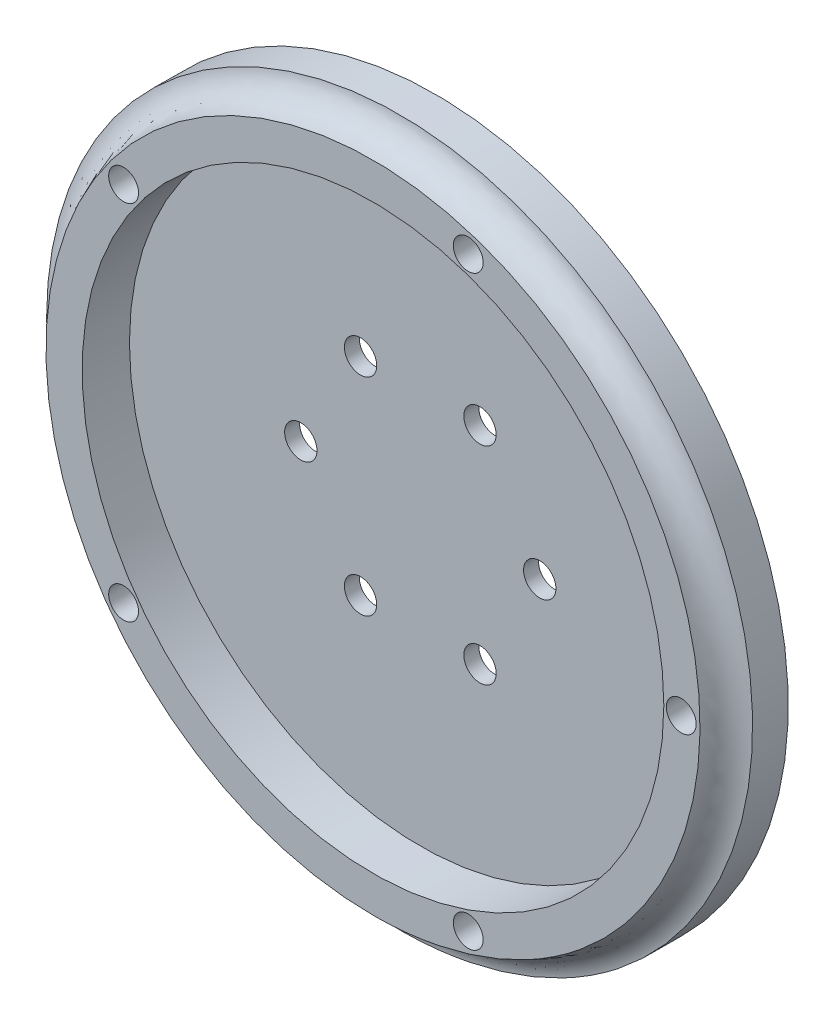
ISO-10303-21;
HEADER;
FILE_DESCRIPTION(('STEP AP214'),'2;1');
FILE_NAME('part.step','',(''),(''),'','','');
FILE_SCHEMA(('AUTOMOTIVE_DESIGN { 1 0 10303 214 1 1 1 1 }'));
ENDSEC;
DATA;
#1=APPLICATION_CONTEXT('core data for automotive mechanical design processes');
#2=APPLICATION_PROTOCOL_DEFINITION('international standard','automotive_design',2000,#1);
#3=PRODUCT_CONTEXT('',#1,'mechanical');
#4=PRODUCT('Part','Part','',(#3));
#5=PRODUCT_RELATED_PRODUCT_CATEGORY('part','',(#4));
#6=PRODUCT_DEFINITION_FORMATION('','',#4);
#7=PRODUCT_DEFINITION_CONTEXT('part definition',#1,'design');
#8=PRODUCT_DEFINITION('design','',#6,#7);
#9=PRODUCT_DEFINITION_SHAPE('','',#8);
#10=(LENGTH_UNIT() NAMED_UNIT(*) SI_UNIT(.MILLI.,.METRE.));
#11=(NAMED_UNIT(*) PLANE_ANGLE_UNIT() SI_UNIT($,.RADIAN.));
#12=(NAMED_UNIT(*) SI_UNIT($,.STERADIAN.) SOLID_ANGLE_UNIT());
#13=UNCERTAINTY_MEASURE_WITH_UNIT(LENGTH_MEASURE(1.E-05),#10,'distance_accuracy_value','');
#14=(GEOMETRIC_REPRESENTATION_CONTEXT(3) GLOBAL_UNCERTAINTY_ASSIGNED_CONTEXT((#13)) GLOBAL_UNIT_ASSIGNED_CONTEXT((#10,
#11,#12)) REPRESENTATION_CONTEXT('',''));
#15=CARTESIAN_POINT('',(0.,0.,0.));
#16=DIRECTION('',(0.,0.,1.));
#17=DIRECTION('',(1.,0.,0.));
#18=AXIS2_PLACEMENT_3D('',#15,#16,#17);
#19=CARTESIAN_POINT('',(0.,0.,68.3518381281178));
#20=DIRECTION('',(0.,0.,1.));
#21=DIRECTION('',(1.,0.,0.));
#22=AXIS2_PLACEMENT_3D('',#19,#20,#21);
#23=PLANE('',#22);
#24=CARTESIAN_POINT('',(42.1760007393588,57.3172158216385,68.3518381281178));
#25=DIRECTION('',(0.,0.,1.));
#26=DIRECTION('',(1.,0.,0.));
#27=AXIS2_PLACEMENT_3D('',#24,#25,#26);
#28=CIRCLE('',#27,1.5);
#29=CARTESIAN_POINT('',(43.6760007393588,57.3172158216385,68.3518381281178));
#30=VERTEX_POINT('',#29);
#31=EDGE_CURVE('E62',#30,#30,#28,.F.);
#32=ORIENTED_EDGE('',*,*,#31,.T.);
#33=EDGE_LOOP('',(#32));
#34=FACE_BOUND('',#33,.T.);
#35=CARTESIAN_POINT('',(20.778788133224,27.8664792420763,68.3518381281178));
#36=DIRECTION('',(0.,0.,1.));
#37=DIRECTION('',(1.,0.,0.));
#38=AXIS2_PLACEMENT_3D('',#35,#36,#37);
#39=CIRCLE('',#38,1.5);
#40=CARTESIAN_POINT('',(22.278788133224,27.8664792420763,68.3518381281178));
#41=VERTEX_POINT('',#40);
#42=EDGE_CURVE('E122',#41,#41,#39,.F.);
#43=ORIENTED_EDGE('',*,*,#42,.T.);
#44=EDGE_LOOP('',(#43));
#45=FACE_BOUND('',#44,.T.);
#46=CARTESIAN_POINT('',(-13.8426291280109,75.5187720215277,68.3518381281178));
#47=DIRECTION('',(0.,0.,1.));
#48=DIRECTION('',(1.,0.,0.));
#49=AXIS2_PLACEMENT_3D('',#46,#47,#48);
#50=CIRCLE('',#49,1.5);
#51=CARTESIAN_POINT('',(-12.3426291280109,75.5187720215277,68.3518381281178));
#52=VERTEX_POINT('',#51);
#53=EDGE_CURVE('E128',#52,#52,#50,.F.);
#54=ORIENTED_EDGE('',*,*,#53,.T.);
#55=EDGE_LOOP('',(#54));
#56=FACE_BOUND('',#55,.T.);
#57=CARTESIAN_POINT('',(11.2096637499569,57.3172158216385,68.3518381281178));
#58=DIRECTION('',(0.,0.,-1.));
#59=DIRECTION('',(-1.,0.,0.));
#60=AXIS2_PLACEMENT_3D('',#57,#58,#59);
#61=CIRCLE('',#60,32.8540791111458);
#62=CARTESIAN_POINT('',(0.,88.1997991471042,68.3518381281178));
#63=VERTEX_POINT('',#62);
#64=EDGE_CURVE('E51',#63,#63,#61,.F.);
#65=ORIENTED_EDGE('',*,*,#64,.T.);
#66=EDGE_LOOP('',(#65));
#67=FACE_BOUND('',#66,.T.);
#68=CARTESIAN_POINT('',(-13.8426291280106,39.115659621749,68.3518381281178));
#69=DIRECTION('',(0.,0.,1.));
#70=DIRECTION('',(1.,0.,0.));
#71=AXIS2_PLACEMENT_3D('',#68,#69,#70);
#72=CIRCLE('',#71,1.5);
#73=CARTESIAN_POINT('',(-12.3426291280106,39.115659621749,68.3518381281178));
#74=VERTEX_POINT('',#73);
#75=EDGE_CURVE('E125',#74,#74,#72,.F.);
#76=ORIENTED_EDGE('',*,*,#75,.T.);
#77=EDGE_LOOP('',(#76));
#78=FACE_BOUND('',#77,.T.);
#79=CARTESIAN_POINT('',(20.7787881332235,86.7679524012009,68.3518381281178));
#80=DIRECTION('',(0.,0.,1.));
#81=DIRECTION('',(1.,0.,0.));
#82=AXIS2_PLACEMENT_3D('',#79,#80,#81);
#83=CIRCLE('',#82,1.5);
#84=CARTESIAN_POINT('',(22.2787881332235,86.7679524012009,68.3518381281178));
#85=VERTEX_POINT('',#84);
#86=EDGE_CURVE('E119',#85,#85,#83,.F.);
#87=ORIENTED_EDGE('',*,*,#86,.T.);
#88=EDGE_LOOP('',(#87));
#89=FACE_BOUND('',#88,.T.);
#90=CARTESIAN_POINT('',(11.2096637499569,57.3172158216385,68.3518381281178));
#91=DIRECTION('',(0.,0.,1.));
#92=DIRECTION('',(1.,0.,0.));
#93=AXIS2_PLACEMENT_3D('',#90,#91,#92);
#94=CIRCLE('',#93,29.2163369894019);
#95=CARTESIAN_POINT('',(40.4260007393588,57.3172158216385,68.3518381281178));
#96=VERTEX_POINT('',#95);
#97=EDGE_CURVE('E56',#96,#96,#94,.T.);
#98=ORIENTED_EDGE('',*,*,#97,.F.);
#99=EDGE_LOOP('',(#98));
#100=FACE_BOUND('',#99,.T.);
#101=ADVANCED_FACE('F34',(#34,#45,#56,#67,#78,#89,#100),#23,.T.);
#102=CARTESIAN_POINT('',(11.2096637499569,57.3172158216385,-20.534441898432));
#103=DIRECTION('',(0.,0.,1.));
#104=DIRECTION('',(1.,0.,0.));
#105=AXIS2_PLACEMENT_3D('',#102,#103,#104);
#106=CYLINDRICAL_SURFACE('',#105,29.2163369894019);
#107=CARTESIAN_POINT('',(11.2096637499569,57.3172158216385,63.6018381281178));
#108=DIRECTION('',(0.,0.,-1.));
#109=DIRECTION('',(-1.,0.,0.));
#110=AXIS2_PLACEMENT_3D('',#107,#108,#109);
#111=CIRCLE('',#110,29.2163369894019);
#112=CARTESIAN_POINT('',(-18.006673239445,57.3172158216385,63.6018381281178));
#113=VERTEX_POINT('',#112);
#114=EDGE_CURVE('E59',#113,#113,#111,.T.);
#115=ORIENTED_EDGE('',*,*,#114,.T.);
#116=EDGE_LOOP('',(#115));
#117=FACE_BOUND('',#116,.T.);
#118=ORIENTED_EDGE('',*,*,#97,.T.);
#119=EDGE_LOOP('',(#118));
#120=FACE_BOUND('',#119,.T.);
#121=ADVANCED_FACE('F133',(#117,#120),#106,.F.);
#122=CARTESIAN_POINT('',(42.1760007393588,57.3172158216385,74.6018381281178));
#123=DIRECTION('',(0.,0.,-1.));
#124=DIRECTION('',(-1.,0.,0.));
#125=AXIS2_PLACEMENT_3D('',#122,#123,#124);
#126=CYLINDRICAL_SURFACE('',#125,1.5);
#127=CARTESIAN_POINT('',(42.1760007393588,57.3172158216385,62.1018381281178));
#128=DIRECTION('',(0.,0.,-1.));
#129=DIRECTION('',(-1.,0.,0.));
#130=AXIS2_PLACEMENT_3D('',#127,#128,#129);
#131=CIRCLE('',#130,1.5);
#132=CARTESIAN_POINT('',(40.6760007393588,57.3172158216385,62.1018381281178));
#133=VERTEX_POINT('',#132);
#134=EDGE_CURVE('E67',#133,#133,#131,.T.);
#135=ORIENTED_EDGE('',*,*,#134,.T.);
#136=EDGE_LOOP('',(#135));
#137=FACE_BOUND('',#136,.T.);
#138=ORIENTED_EDGE('',*,*,#31,.F.);
#139=EDGE_LOOP('',(#138));
#140=FACE_BOUND('',#139,.T.);
#141=ADVANCED_FACE('F144',(#137,#140),#126,.F.);
#142=CARTESIAN_POINT('',(20.7787881332235,86.7679524012009,74.6018381281178));
#143=DIRECTION('',(0.,0.,-1.));
#144=DIRECTION('',(-1.,0.,0.));
#145=AXIS2_PLACEMENT_3D('',#142,#143,#144);
#146=CYLINDRICAL_SURFACE('',#145,1.5);
#147=CARTESIAN_POINT('',(20.7787881332235,86.7679524012009,62.1018381281178));
#148=DIRECTION('',(0.,0.,-1.));
#149=DIRECTION('',(-0.309016994374945,-0.951056516295155,0.));
#150=AXIS2_PLACEMENT_3D('',#147,#148,#149);
#151=CIRCLE('',#150,1.5);
#152=CARTESIAN_POINT('',(20.3152626416611,85.3413676267581,62.1018381281178));
#153=VERTEX_POINT('',#152);
#154=EDGE_CURVE('E70',#153,#153,#151,.T.);
#155=ORIENTED_EDGE('',*,*,#154,.T.);
#156=EDGE_LOOP('',(#155));
#157=FACE_BOUND('',#156,.T.);
#158=ORIENTED_EDGE('',*,*,#86,.F.);
#159=EDGE_LOOP('',(#158));
#160=FACE_BOUND('',#159,.T.);
#161=ADVANCED_FACE('F150',(#157,#160),#146,.F.);
#162=CARTESIAN_POINT('',(20.778788133224,27.8664792420763,74.6018381281178));
#163=DIRECTION('',(0.,0.,-1.));
#164=DIRECTION('',(-1.,0.,0.));
#165=AXIS2_PLACEMENT_3D('',#162,#163,#164);
#166=CYLINDRICAL_SURFACE('',#165,1.5);
#167=CARTESIAN_POINT('',(20.778788133224,27.8664792420763,62.1018381281178));
#168=DIRECTION('',(0.,0.,-1.));
#169=DIRECTION('',(-0.309016994374958,0.95105651629515,0.));
#170=AXIS2_PLACEMENT_3D('',#167,#168,#169);
#171=CIRCLE('',#170,1.5);
#172=CARTESIAN_POINT('',(20.3152626416615,29.293064016519,62.1018381281178));
#173=VERTEX_POINT('',#172);
#174=EDGE_CURVE('E74',#173,#173,#171,.T.);
#175=ORIENTED_EDGE('',*,*,#174,.T.);
#176=EDGE_LOOP('',(#175));
#177=FACE_BOUND('',#176,.T.);
#178=ORIENTED_EDGE('',*,*,#42,.F.);
#179=EDGE_LOOP('',(#178));
#180=FACE_BOUND('',#179,.T.);
#181=ADVANCED_FACE('F177',(#177,#180),#166,.F.);
#182=CARTESIAN_POINT('',(-13.8426291280106,39.115659621749,74.6018381281178));
#183=DIRECTION('',(0.,0.,-1.));
#184=DIRECTION('',(-1.,0.,0.));
#185=AXIS2_PLACEMENT_3D('',#182,#183,#184);
#186=CYLINDRICAL_SURFACE('',#185,1.5);
#187=CARTESIAN_POINT('',(-13.8426291280106,39.115659621749,62.1018381281178));
#188=DIRECTION('',(0.,0.,-1.));
#189=DIRECTION('',(0.809016994374942,0.58778525229248,0.));
#190=AXIS2_PLACEMENT_3D('',#187,#188,#189);
#191=CIRCLE('',#190,1.5);
#192=CARTESIAN_POINT('',(-12.6291036364482,39.9973375001877,62.1018381281178));
#193=VERTEX_POINT('',#192);
#194=EDGE_CURVE('E78',#193,#193,#191,.T.);
#195=ORIENTED_EDGE('',*,*,#194,.T.);
#196=EDGE_LOOP('',(#195));
#197=FACE_BOUND('',#196,.T.);
#198=ORIENTED_EDGE('',*,*,#75,.F.);
#199=EDGE_LOOP('',(#198));
#200=FACE_BOUND('',#199,.T.);
#201=ADVANCED_FACE('F171',(#197,#200),#186,.F.);
#202=CARTESIAN_POINT('',(-13.8426291280109,75.5187720215277,74.6018381281178));
#203=DIRECTION('',(0.,0.,-1.));
#204=DIRECTION('',(-1.,0.,0.));
#205=AXIS2_PLACEMENT_3D('',#202,#203,#204);
#206=CYLINDRICAL_SURFACE('',#205,1.5);
#207=CARTESIAN_POINT('',(-13.8426291280109,75.5187720215277,62.1018381281178));
#208=DIRECTION('',(0.,0.,-1.));
#209=DIRECTION('',(0.809016994374951,-0.587785252292469,0.));
#210=AXIS2_PLACEMENT_3D('',#207,#208,#209);
#211=CIRCLE('',#210,1.5);
#212=CARTESIAN_POINT('',(-12.6291036364485,74.637094143089,62.1018381281178));
#213=VERTEX_POINT('',#212);
#214=EDGE_CURVE('E73',#213,#213,#211,.T.);
#215=ORIENTED_EDGE('',*,*,#214,.T.);
#216=EDGE_LOOP('',(#215));
#217=FACE_BOUND('',#216,.T.);
#218=ORIENTED_EDGE('',*,*,#53,.F.);
#219=EDGE_LOOP('',(#218));
#220=FACE_BOUND('',#219,.T.);
#221=ADVANCED_FACE('F164',(#217,#220),#206,.F.);
#222=CARTESIAN_POINT('',(0.,91.36049527296,65.6518381281178));
#223=CARTESIAN_POINT('',(68.0865589026431,113.779822772874,65.6518381281178));
#224=CARTESIAN_POINT('',(90.5058864025569,45.6932638702307,65.6518381281178));
#225=CARTESIAN_POINT('',(22.4193274999138,23.273936370317,65.6518381281178));
#226=CARTESIAN_POINT('',(-45.6672314027293,0.854608870403187,65.6518381281178));
#227=CARTESIAN_POINT('',(-68.0865589026431,68.9411677730463,65.6518381281178));
#228=CARTESIAN_POINT('',(0.,91.36049527296,65.6518381281178));
#229=CARTESIAN_POINT('',(0.,97.7604952729601,65.6518381281178));
#230=CARTESIAN_POINT('',(80.8865589026431,120.179822772874,65.6518381281178));
#231=CARTESIAN_POINT('',(103.305886402557,39.2932638702307,65.6518381281178));
#232=CARTESIAN_POINT('',(22.4193274999138,16.8739363703169,65.6518381281178));
#233=CARTESIAN_POINT('',(-58.4672314027294,-5.54539112959684,65.6518381281178));
#234=CARTESIAN_POINT('',(-80.8865589026431,75.3411677730463,65.6518381281178));
#235=CARTESIAN_POINT('',(0.,97.7604952729601,65.6518381281178));
#236=CARTESIAN_POINT('',(0.,97.7604952729601,72.0518381281179));
#237=CARTESIAN_POINT('',(80.8865589026431,120.179822772874,72.0518381281179));
#238=CARTESIAN_POINT('',(103.305886402557,39.2932638702307,72.0518381281179));
#239=CARTESIAN_POINT('',(22.4193274999138,16.8739363703169,72.0518381281179));
#240=CARTESIAN_POINT('',(-58.4672314027294,-5.54539112959684,72.0518381281179));
#241=CARTESIAN_POINT('',(-80.8865589026431,75.3411677730463,72.0518381281179));
#242=CARTESIAN_POINT('',(0.,97.7604952729601,72.0518381281179));
#243=CARTESIAN_POINT('',(0.,91.36049527296,72.0518381281179));
#244=CARTESIAN_POINT('',(68.0865589026431,113.779822772874,72.0518381281179));
#245=CARTESIAN_POINT('',(90.5058864025569,45.6932638702307,72.0518381281179));
#246=CARTESIAN_POINT('',(22.4193274999138,23.273936370317,72.0518381281179));
#247=CARTESIAN_POINT('',(-45.6672314027293,0.854608870403187,72.0518381281179));
#248=CARTESIAN_POINT('',(-68.0865589026431,68.9411677730463,72.0518381281179));
#249=CARTESIAN_POINT('',(0.,91.36049527296,72.0518381281179));
#250=CARTESIAN_POINT('',(0.,84.96049527296,72.0518381281179));
#251=CARTESIAN_POINT('',(55.286558902643,107.379822772874,72.0518381281179));
#252=CARTESIAN_POINT('',(77.7058864025568,52.0932638702308,72.0518381281179));
#253=CARTESIAN_POINT('',(22.4193274999138,29.673936370317,72.0518381281179));
#254=CARTESIAN_POINT('',(-32.8672314027292,7.25460887040322,72.0518381281179));
#255=CARTESIAN_POINT('',(-55.286558902643,62.5411677730462,72.0518381281179));
#256=CARTESIAN_POINT('',(0.,84.96049527296,72.0518381281179));
#257=CARTESIAN_POINT('',(0.,84.96049527296,65.6518381281178));
#258=CARTESIAN_POINT('',(55.286558902643,107.379822772874,65.6518381281178));
#259=CARTESIAN_POINT('',(77.7058864025568,52.0932638702308,65.6518381281178));
#260=CARTESIAN_POINT('',(22.4193274999138,29.673936370317,65.6518381281178));
#261=CARTESIAN_POINT('',(-32.8672314027292,7.25460887040322,65.6518381281178));
#262=CARTESIAN_POINT('',(-55.286558902643,62.5411677730462,65.6518381281178));
#263=CARTESIAN_POINT('',(0.,84.96049527296,65.6518381281178));
#264=CARTESIAN_POINT('',(0.,91.36049527296,65.6518381281178));
#265=CARTESIAN_POINT('',(68.0865589026431,113.779822772874,65.6518381281178));
#266=CARTESIAN_POINT('',(90.5058864025569,45.6932638702307,65.6518381281178));
#267=CARTESIAN_POINT('',(22.4193274999138,23.273936370317,65.6518381281178));
#268=CARTESIAN_POINT('',(-45.6672314027293,0.854608870403187,65.6518381281178));
#269=CARTESIAN_POINT('',(-68.0865589026431,68.9411677730463,65.6518381281178));
#270=CARTESIAN_POINT('',(0.,91.36049527296,65.6518381281178));
#271=(BOUNDED_SURFACE() B_SPLINE_SURFACE(3,3,((#222,#223,#224,#225,#226,#227,#228),(#229,#230,
#231,#232,#233,#234,#235),(#236,#237,#238,#239,#240,#241,#242),(#243,#244,#245,#246,#247,#248,
#249),(#250,#251,#252,#253,#254,#255,#256),(#257,#258,#259,#260,#261,#262,#263),(#264,#265,#266,
#267,#268,#269,#270)),.UNSPECIFIED.,.T.,.T.,.F.) B_SPLINE_SURFACE_WITH_KNOTS((4,3,4),(4,3,4),
(0.,0.5,1.),(0.,0.5,1.),
.UNSPECIFIED.) GEOMETRIC_REPRESENTATION_ITEM() RATIONAL_B_SPLINE_SURFACE(((1.,0.333333333333333,
0.333333333333333,1.,0.333333333333333,0.333333333333333,1.),(0.333333333333333,
0.111111111111111,0.111111111111111,0.333333333333333,0.111111111111111,0.111111111111111,
0.333333333333333),(0.333333333333333,0.111111111111111,0.111111111111111,0.333333333333333,
0.111111111111111,0.111111111111111,0.333333333333333),(1.,0.333333333333333,0.333333333333333,
1.,0.333333333333333,0.333333333333333,1.),(0.333333333333333,0.111111111111111,
0.111111111111111,0.333333333333333,0.111111111111111,0.111111111111111,0.333333333333333),
(0.333333333333333,0.111111111111111,0.111111111111111,0.333333333333333,0.111111111111111,
0.111111111111111,0.333333333333333),(1.,0.333333333333333,0.333333333333333,1.,
0.333333333333333,0.333333333333333,1.))) REPRESENTATION_ITEM('') SURFACE());
#272=CARTESIAN_POINT('',(0.,91.36049527296,68.8518381281178));
#273=DIRECTION('',(1.,0.,0.));
#274=DIRECTION('',(0.,0.,-1.));
#275=AXIS2_PLACEMENT_3D('',#272,#273,#274);
#276=CIRCLE('',#275,3.20000000000001);
#277=CARTESIAN_POINT('',(0.,90.965462403871,65.6763147016038));
#278=VERTEX_POINT('',#277);
#279=EDGE_CURVE('E11',#63,#278,#276,.T.);
#280=CARTESIAN_POINT('',(11.2096637499569,57.3172158216385,65.6763147016038));
#281=DIRECTION('',(0.,0.,-1.));
#282=DIRECTION('',(-1.,0.,0.));
#283=AXIS2_PLACEMENT_3D('',#280,#281,#282);
#284=CIRCLE('',#283,35.4663369894019);
#285=EDGE_CURVE('E53',#278,#278,#284,.F.);
#286=ORIENTED_EDGE('',*,*,#64,.F.);
#287=ORIENTED_EDGE('',*,*,#279,.T.);
#288=ORIENTED_EDGE('',*,*,#285,.T.);
#289=ORIENTED_EDGE('',*,*,#279,.F.);
#290=EDGE_LOOP('',(#286,#287,#288,#289));
#291=FACE_BOUND('',#290,.T.);
#292=ADVANCED_FACE('F36',(#291),#271,.F.);
#293=CARTESIAN_POINT('',(11.2096637499569,57.3172158216385,74.6018381281178));
#294=DIRECTION('',(0.,0.,-1.));
#295=DIRECTION('',(-1.,0.,0.));
#296=AXIS2_PLACEMENT_3D('',#293,#294,#295);
#297=CYLINDRICAL_SURFACE('',#296,35.4663369894019);
#298=ORIENTED_EDGE('',*,*,#285,.F.);
#299=EDGE_LOOP('',(#298));
#300=FACE_BOUND('',#299,.T.);
#301=CARTESIAN_POINT('',(11.2096637499569,57.3172158216385,62.1018381281178));
#302=DIRECTION('',(0.,0.,-1.));
#303=DIRECTION('',(-1.,0.,0.));
#304=AXIS2_PLACEMENT_3D('',#301,#302,#303);
#305=CIRCLE('',#304,35.4663369894019);
#306=CARTESIAN_POINT('',(-24.256673239445,57.3172158216385,62.1018381281178));
#307=VERTEX_POINT('',#306);
#308=EDGE_CURVE('E55',#307,#307,#305,.T.);
#309=ORIENTED_EDGE('',*,*,#308,.F.);
#310=EDGE_LOOP('',(#309));
#311=FACE_BOUND('',#310,.T.);
#312=ADVANCED_FACE('F154',(#300,#311),#297,.T.);
#313=CARTESIAN_POINT('',(11.2096637499569,57.3172158216385,62.1018381281178));
#314=DIRECTION('',(0.,0.,-1.));
#315=DIRECTION('',(-1.,0.,0.));
#316=AXIS2_PLACEMENT_3D('',#313,#314,#315);
#317=PLANE('',#316);
#318=CARTESIAN_POINT('',(17.2096637499569,46.9249109762253,62.1018381281178));
#319=DIRECTION('',(0.,0.,1.));
#320=DIRECTION('',(-0.500000000000004,0.866025403784436,0.));
#321=AXIS2_PLACEMENT_3D('',#318,#319,#320);
#322=CIRCLE('',#321,1.625);
#323=CARTESIAN_POINT('',(16.3971637499569,48.332202257375,62.1018381281178));
#324=VERTEX_POINT('',#323);
#325=EDGE_CURVE('E92',#324,#324,#322,.T.);
#326=ORIENTED_EDGE('',*,*,#325,.T.);
#327=EDGE_LOOP('',(#326));
#328=FACE_BOUND('',#327,.T.);
#329=CARTESIAN_POINT('',(23.2096637499569,57.3172158216385,62.1018381281178));
#330=DIRECTION('',(0.,0.,1.));
#331=DIRECTION('',(-1.,0.,0.));
#332=AXIS2_PLACEMENT_3D('',#329,#330,#331);
#333=CIRCLE('',#332,1.625);
#334=CARTESIAN_POINT('',(21.5846637499569,57.3172158216385,62.1018381281178));
#335=VERTEX_POINT('',#334);
#336=EDGE_CURVE('E109',#335,#335,#333,.T.);
#337=ORIENTED_EDGE('',*,*,#336,.T.);
#338=EDGE_LOOP('',(#337));
#339=FACE_BOUND('',#338,.T.);
#340=CARTESIAN_POINT('',(17.2096637499568,67.7095206670518,62.1018381281178));
#341=DIRECTION('',(0.,0.,1.));
#342=DIRECTION('',(-0.499999999999992,-0.866025403784443,0.));
#343=AXIS2_PLACEMENT_3D('',#340,#341,#342);
#344=CIRCLE('',#343,1.625);
#345=CARTESIAN_POINT('',(16.3971637499568,66.3022293859021,62.1018381281178));
#346=VERTEX_POINT('',#345);
#347=EDGE_CURVE('E103',#346,#346,#344,.T.);
#348=ORIENTED_EDGE('',*,*,#347,.T.);
#349=EDGE_LOOP('',(#348));
#350=FACE_BOUND('',#349,.T.);
#351=CARTESIAN_POINT('',(5.20966374995677,67.7095206670517,62.1018381281178));
#352=DIRECTION('',(0.,0.,1.));
#353=DIRECTION('',(0.50000000000001,-0.866025403784433,0.));
#354=AXIS2_PLACEMENT_3D('',#351,#352,#353);
#355=CIRCLE('',#354,1.625);
#356=CARTESIAN_POINT('',(6.02216374995678,66.302229385902,62.1018381281178));
#357=VERTEX_POINT('',#356);
#358=EDGE_CURVE('E97',#357,#357,#355,.T.);
#359=ORIENTED_EDGE('',*,*,#358,.T.);
#360=EDGE_LOOP('',(#359));
#361=FACE_BOUND('',#360,.T.);
#362=CARTESIAN_POINT('',(5.20966374995691,46.9249109762252,62.1018381281178));
#363=DIRECTION('',(0.,0.,1.));
#364=DIRECTION('',(0.499999999999998,0.86602540378444,0.));
#365=AXIS2_PLACEMENT_3D('',#362,#363,#364);
#366=CIRCLE('',#365,1.625);
#367=CARTESIAN_POINT('',(6.02216374995691,48.3322022573749,62.1018381281178));
#368=VERTEX_POINT('',#367);
#369=EDGE_CURVE('E86',#368,#368,#366,.T.);
#370=ORIENTED_EDGE('',*,*,#369,.T.);
#371=EDGE_LOOP('',(#370));
#372=FACE_BOUND('',#371,.T.);
#373=CARTESIAN_POINT('',(-0.790336250043112,57.3172158216385,62.1018381281178));
#374=DIRECTION('',(0.,0.,1.));
#375=DIRECTION('',(1.,0.,0.));
#376=AXIS2_PLACEMENT_3D('',#373,#374,#375);
#377=CIRCLE('',#376,1.625);
#378=CARTESIAN_POINT('',(0.834663749956889,57.3172158216385,62.1018381281178));
#379=VERTEX_POINT('',#378);
#380=EDGE_CURVE('E77',#379,#379,#377,.T.);
#381=ORIENTED_EDGE('',*,*,#380,.T.);
#382=EDGE_LOOP('',(#381));
#383=FACE_BOUND('',#382,.T.);
#384=ORIENTED_EDGE('',*,*,#214,.F.);
#385=EDGE_LOOP('',(#384));
#386=FACE_BOUND('',#385,.T.);
#387=ORIENTED_EDGE('',*,*,#194,.F.);
#388=EDGE_LOOP('',(#387));
#389=FACE_BOUND('',#388,.T.);
#390=ORIENTED_EDGE('',*,*,#174,.F.);
#391=EDGE_LOOP('',(#390));
#392=FACE_BOUND('',#391,.T.);
#393=ORIENTED_EDGE('',*,*,#154,.F.);
#394=EDGE_LOOP('',(#393));
#395=FACE_BOUND('',#394,.T.);
#396=ORIENTED_EDGE('',*,*,#134,.F.);
#397=EDGE_LOOP('',(#396));
#398=FACE_BOUND('',#397,.T.);
#399=ORIENTED_EDGE('',*,*,#308,.T.);
#400=EDGE_LOOP('',(#399));
#401=FACE_BOUND('',#400,.T.);
#402=ADVANCED_FACE('F156',(#328,#339,#350,#361,#372,#383,#386,#389,#392,#395,#398,#401),#317,.T.);
#403=CARTESIAN_POINT('',(11.2096637499569,57.3172158216385,63.6018381281178));
#404=DIRECTION('',(0.,0.,-1.));
#405=DIRECTION('',(-1.,0.,0.));
#406=AXIS2_PLACEMENT_3D('',#403,#404,#405);
#407=PLANE('',#406);
#408=CARTESIAN_POINT('',(17.2096637499569,46.9249109762253,63.6018381281178));
#409=DIRECTION('',(0.,0.,1.));
#410=DIRECTION('',(-0.500000000000004,0.866025403784436,0.));
#411=AXIS2_PLACEMENT_3D('',#408,#409,#410);
#412=CIRCLE('',#411,1.625);
#413=CARTESIAN_POINT('',(16.3971637499569,48.332202257375,63.6018381281178));
#414=VERTEX_POINT('',#413);
#415=EDGE_CURVE('E112',#414,#414,#412,.T.);
#416=ORIENTED_EDGE('',*,*,#415,.F.);
#417=EDGE_LOOP('',(#416));
#418=FACE_BOUND('',#417,.T.);
#419=CARTESIAN_POINT('',(23.2096637499569,57.3172158216385,63.6018381281178));
#420=DIRECTION('',(0.,0.,1.));
#421=DIRECTION('',(-1.,0.,0.));
#422=AXIS2_PLACEMENT_3D('',#419,#420,#421);
#423=CIRCLE('',#422,1.625);
#424=CARTESIAN_POINT('',(21.5846637499569,57.3172158216385,63.6018381281178));
#425=VERTEX_POINT('',#424);
#426=EDGE_CURVE('E106',#425,#425,#423,.T.);
#427=ORIENTED_EDGE('',*,*,#426,.F.);
#428=EDGE_LOOP('',(#427));
#429=FACE_BOUND('',#428,.T.);
#430=CARTESIAN_POINT('',(17.2096637499568,67.7095206670518,63.6018381281178));
#431=DIRECTION('',(0.,0.,1.));
#432=DIRECTION('',(-0.499999999999992,-0.866025403784443,0.));
#433=AXIS2_PLACEMENT_3D('',#430,#431,#432);
#434=CIRCLE('',#433,1.625);
#435=CARTESIAN_POINT('',(16.3971637499568,66.3022293859021,63.6018381281178));
#436=VERTEX_POINT('',#435);
#437=EDGE_CURVE('E100',#436,#436,#434,.T.);
#438=ORIENTED_EDGE('',*,*,#437,.F.);
#439=EDGE_LOOP('',(#438));
#440=FACE_BOUND('',#439,.T.);
#441=CARTESIAN_POINT('',(5.20966374995677,67.7095206670517,63.6018381281178));
#442=DIRECTION('',(0.,0.,1.));
#443=DIRECTION('',(0.50000000000001,-0.866025403784433,0.));
#444=AXIS2_PLACEMENT_3D('',#441,#442,#443);
#445=CIRCLE('',#444,1.625);
#446=CARTESIAN_POINT('',(6.02216374995678,66.302229385902,63.6018381281178));
#447=VERTEX_POINT('',#446);
#448=EDGE_CURVE('E44',#447,#447,#445,.T.);
#449=ORIENTED_EDGE('',*,*,#448,.F.);
#450=EDGE_LOOP('',(#449));
#451=FACE_BOUND('',#450,.T.);
#452=CARTESIAN_POINT('',(5.20966374995691,46.9249109762252,63.6018381281178));
#453=DIRECTION('',(0.,0.,1.));
#454=DIRECTION('',(0.499999999999998,0.86602540378444,0.));
#455=AXIS2_PLACEMENT_3D('',#452,#453,#454);
#456=CIRCLE('',#455,1.625);
#457=CARTESIAN_POINT('',(6.02216374995691,48.3322022573749,63.6018381281178));
#458=VERTEX_POINT('',#457);
#459=EDGE_CURVE('E89',#458,#458,#456,.T.);
#460=ORIENTED_EDGE('',*,*,#459,.F.);
#461=EDGE_LOOP('',(#460));
#462=FACE_BOUND('',#461,.T.);
#463=CARTESIAN_POINT('',(-0.790336250043112,57.3172158216385,63.6018381281178));
#464=DIRECTION('',(0.,0.,1.));
#465=DIRECTION('',(1.,0.,0.));
#466=AXIS2_PLACEMENT_3D('',#463,#464,#465);
#467=CIRCLE('',#466,1.625);
#468=CARTESIAN_POINT('',(0.834663749956889,57.3172158216385,63.6018381281178));
#469=VERTEX_POINT('',#468);
#470=EDGE_CURVE('E83',#469,#469,#467,.T.);
#471=ORIENTED_EDGE('',*,*,#470,.F.);
#472=EDGE_LOOP('',(#471));
#473=FACE_BOUND('',#472,.T.);
#474=ORIENTED_EDGE('',*,*,#114,.F.);
#475=EDGE_LOOP('',(#474));
#476=FACE_BOUND('',#475,.T.);
#477=ADVANCED_FACE('F161',(#418,#429,#440,#451,#462,#473,#476),#407,.F.);
#478=CARTESIAN_POINT('',(-0.790336250043112,57.3172158216385,62.1018381281178));
#479=DIRECTION('',(0.,0.,1.));
#480=DIRECTION('',(1.,0.,0.));
#481=AXIS2_PLACEMENT_3D('',#478,#479,#480);
#482=CYLINDRICAL_SURFACE('',#481,1.625);
#483=ORIENTED_EDGE('',*,*,#380,.F.);
#484=EDGE_LOOP('',(#483));
#485=FACE_BOUND('',#484,.T.);
#486=ORIENTED_EDGE('',*,*,#470,.T.);
#487=EDGE_LOOP('',(#486));
#488=FACE_BOUND('',#487,.T.);
#489=ADVANCED_FACE('F238',(#485,#488),#482,.F.);
#490=CARTESIAN_POINT('',(5.20966374995691,46.9249109762252,62.1018381281178));
#491=DIRECTION('',(0.,0.,1.));
#492=DIRECTION('',(1.,0.,0.));
#493=AXIS2_PLACEMENT_3D('',#490,#491,#492);
#494=CYLINDRICAL_SURFACE('',#493,1.625);
#495=ORIENTED_EDGE('',*,*,#369,.F.);
#496=EDGE_LOOP('',(#495));
#497=FACE_BOUND('',#496,.T.);
#498=ORIENTED_EDGE('',*,*,#459,.T.);
#499=EDGE_LOOP('',(#498));
#500=FACE_BOUND('',#499,.T.);
#501=ADVANCED_FACE('F248',(#497,#500),#494,.F.);
#502=CARTESIAN_POINT('',(5.20966374995677,67.7095206670517,62.1018381281178));
#503=DIRECTION('',(0.,0.,1.));
#504=DIRECTION('',(1.,0.,0.));
#505=AXIS2_PLACEMENT_3D('',#502,#503,#504);
#506=CYLINDRICAL_SURFACE('',#505,1.625);
#507=ORIENTED_EDGE('',*,*,#358,.F.);
#508=EDGE_LOOP('',(#507));
#509=FACE_BOUND('',#508,.T.);
#510=ORIENTED_EDGE('',*,*,#448,.T.);
#511=EDGE_LOOP('',(#510));
#512=FACE_BOUND('',#511,.T.);
#513=ADVANCED_FACE('F258',(#509,#512),#506,.F.);
#514=CARTESIAN_POINT('',(17.2096637499568,67.7095206670518,62.1018381281178));
#515=DIRECTION('',(0.,0.,1.));
#516=DIRECTION('',(1.,0.,0.));
#517=AXIS2_PLACEMENT_3D('',#514,#515,#516);
#518=CYLINDRICAL_SURFACE('',#517,1.625);
#519=ORIENTED_EDGE('',*,*,#347,.F.);
#520=EDGE_LOOP('',(#519));
#521=FACE_BOUND('',#520,.T.);
#522=ORIENTED_EDGE('',*,*,#437,.T.);
#523=EDGE_LOOP('',(#522));
#524=FACE_BOUND('',#523,.T.);
#525=ADVANCED_FACE('F268',(#521,#524),#518,.F.);
#526=CARTESIAN_POINT('',(23.2096637499569,57.3172158216385,62.1018381281178));
#527=DIRECTION('',(0.,0.,1.));
#528=DIRECTION('',(1.,0.,0.));
#529=AXIS2_PLACEMENT_3D('',#526,#527,#528);
#530=CYLINDRICAL_SURFACE('',#529,1.625);
#531=ORIENTED_EDGE('',*,*,#336,.F.);
#532=EDGE_LOOP('',(#531));
#533=FACE_BOUND('',#532,.T.);
#534=ORIENTED_EDGE('',*,*,#426,.T.);
#535=EDGE_LOOP('',(#534));
#536=FACE_BOUND('',#535,.T.);
#537=ADVANCED_FACE('F278',(#533,#536),#530,.F.);
#538=CARTESIAN_POINT('',(17.2096637499569,46.9249109762253,62.1018381281178));
#539=DIRECTION('',(0.,0.,1.));
#540=DIRECTION('',(1.,0.,0.));
#541=AXIS2_PLACEMENT_3D('',#538,#539,#540);
#542=CYLINDRICAL_SURFACE('',#541,1.625);
#543=ORIENTED_EDGE('',*,*,#325,.F.);
#544=EDGE_LOOP('',(#543));
#545=FACE_BOUND('',#544,.T.);
#546=ORIENTED_EDGE('',*,*,#415,.T.);
#547=EDGE_LOOP('',(#546));
#548=FACE_BOUND('',#547,.T.);
#549=ADVANCED_FACE('F136',(#545,#548),#542,.F.);
#550=CLOSED_SHELL('',(#101,#121,#141,#161,#181,#201,#221,#292,#312,#402,#477,#489,#501,#513,
#525,#537,#549));
#551=MANIFOLD_SOLID_BREP('B2',#550);
#552=ADVANCED_BREP_SHAPE_REPRESENTATION('',(#18,#551),#14);
#553=SHAPE_DEFINITION_REPRESENTATION(#9,#552);
ENDSEC;
END-ISO-10303-21;
